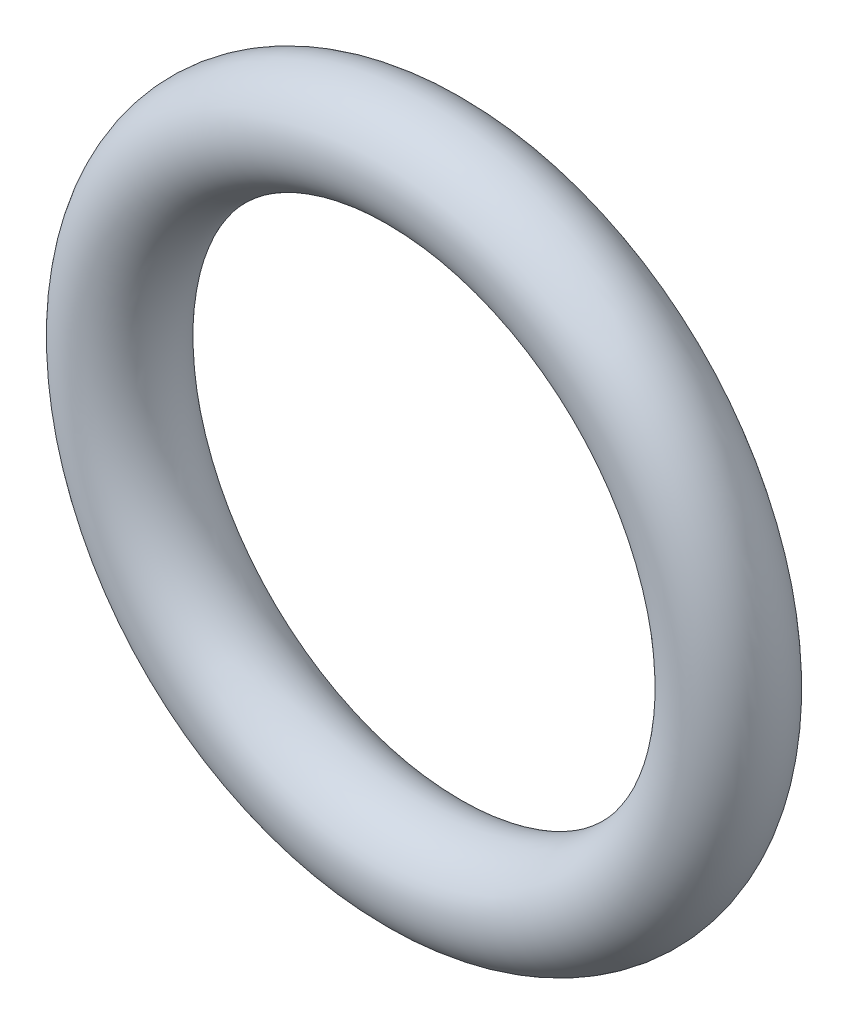
ISO-10303-21;
HEADER;
FILE_DESCRIPTION(('STEP AP214'),'2;1');
FILE_NAME('part.step','',(''),(''),'','','');
FILE_SCHEMA(('AUTOMOTIVE_DESIGN { 1 0 10303 214 1 1 1 1 }'));
ENDSEC;
DATA;
#1=APPLICATION_CONTEXT('core data for automotive mechanical design processes');
#2=APPLICATION_PROTOCOL_DEFINITION('international standard','automotive_design',2000,#1);
#3=PRODUCT_CONTEXT('',#1,'mechanical');
#4=PRODUCT('Part','Part','',(#3));
#5=PRODUCT_RELATED_PRODUCT_CATEGORY('part','',(#4));
#6=PRODUCT_DEFINITION_FORMATION('','',#4);
#7=PRODUCT_DEFINITION_CONTEXT('part definition',#1,'design');
#8=PRODUCT_DEFINITION('design','',#6,#7);
#9=PRODUCT_DEFINITION_SHAPE('','',#8);
#10=(LENGTH_UNIT() NAMED_UNIT(*) SI_UNIT(.MILLI.,.METRE.));
#11=(NAMED_UNIT(*) PLANE_ANGLE_UNIT() SI_UNIT($,.RADIAN.));
#12=(NAMED_UNIT(*) SI_UNIT($,.STERADIAN.) SOLID_ANGLE_UNIT());
#13=UNCERTAINTY_MEASURE_WITH_UNIT(LENGTH_MEASURE(1.E-05),#10,'distance_accuracy_value','');
#14=(GEOMETRIC_REPRESENTATION_CONTEXT(3) GLOBAL_UNCERTAINTY_ASSIGNED_CONTEXT((#13)) GLOBAL_UNIT_ASSIGNED_CONTEXT((#10,
#11,#12)) REPRESENTATION_CONTEXT('',''));
#15=CARTESIAN_POINT('',(0.,0.,0.));
#16=DIRECTION('',(0.,0.,1.));
#17=DIRECTION('',(1.,0.,0.));
#18=AXIS2_PLACEMENT_3D('',#15,#16,#17);
#19=CARTESIAN_POINT('',(0.,-13.39453125,0.));
#20=DIRECTION('',(0.,0.,1.));
#21=DIRECTION('',(1.,0.,0.));
#22=AXIS2_PLACEMENT_3D('',#19,#20,#21);
#23=TOROIDAL_SURFACE('',#22,13.39453125,2.28203125);
#24=CARTESIAN_POINT('',(0.,0.,0.));
#25=DIRECTION('',(1.,0.,0.));
#26=DIRECTION('',(0.,0.,-1.));
#27=AXIS2_PLACEMENT_3D('',#24,#25,#26);
#28=CIRCLE('',#27,2.28203125);
#29=CARTESIAN_POINT('',(0.,2.28203124999999,0.));
#30=VERTEX_POINT('',#29);
#31=EDGE_CURVE('E12',#30,#30,#28,.T.);
#32=CARTESIAN_POINT('',(0.,-13.39453125,0.));
#33=DIRECTION('',(0.,0.,1.));
#34=DIRECTION('',(1.,0.,0.));
#35=AXIS2_PLACEMENT_3D('',#32,#33,#34);
#36=CIRCLE('',#35,15.6765625);
#37=EDGE_CURVE('',#30,#30,#36,.T.);
#38=ORIENTED_EDGE('',*,*,#31,.F.);
#39=ORIENTED_EDGE('',*,*,#31,.T.);
#40=ORIENTED_EDGE('',*,*,#37,.T.);
#41=ORIENTED_EDGE('',*,*,#37,.F.);
#42=EDGE_LOOP('',(#38,#40,#39,#41));
#43=FACE_BOUND('',#42,.T.);
#44=ADVANCED_FACE('F40',(#43),#23,.T.);
#45=CLOSED_SHELL('',(#44));
#46=MANIFOLD_SOLID_BREP('B2',#45);
#47=ADVANCED_BREP_SHAPE_REPRESENTATION('',(#18,#46),#14);
#48=SHAPE_DEFINITION_REPRESENTATION(#9,#47);
ENDSEC;
END-ISO-10303-21;
